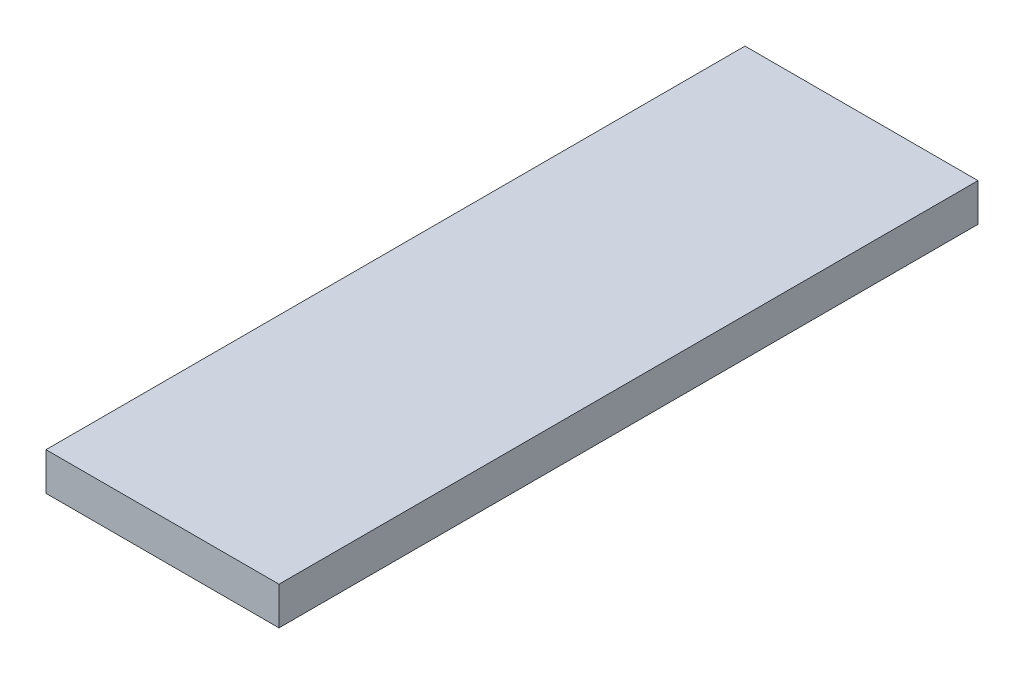
ISO-10303-21;
HEADER;
FILE_DESCRIPTION(('STEP AP214'),'2;1');
FILE_NAME('part.step','',(''),(''),'','','');
FILE_SCHEMA(('AUTOMOTIVE_DESIGN { 1 0 10303 214 1 1 1 1 }'));
ENDSEC;
DATA;
#1=APPLICATION_CONTEXT('core data for automotive mechanical design processes');
#2=APPLICATION_PROTOCOL_DEFINITION('international standard','automotive_design',2000,#1);
#3=PRODUCT_CONTEXT('',#1,'mechanical');
#4=PRODUCT('Part','Part','',(#3));
#5=PRODUCT_RELATED_PRODUCT_CATEGORY('part','',(#4));
#6=PRODUCT_DEFINITION_FORMATION('','',#4);
#7=PRODUCT_DEFINITION_CONTEXT('part definition',#1,'design');
#8=PRODUCT_DEFINITION('design','',#6,#7);
#9=PRODUCT_DEFINITION_SHAPE('','',#8);
#10=(LENGTH_UNIT() NAMED_UNIT(*) SI_UNIT(.MILLI.,.METRE.));
#11=(NAMED_UNIT(*) PLANE_ANGLE_UNIT() SI_UNIT($,.RADIAN.));
#12=(NAMED_UNIT(*) SI_UNIT($,.STERADIAN.) SOLID_ANGLE_UNIT());
#13=UNCERTAINTY_MEASURE_WITH_UNIT(LENGTH_MEASURE(1.E-05),#10,'distance_accuracy_value','');
#14=(GEOMETRIC_REPRESENTATION_CONTEXT(3) GLOBAL_UNCERTAINTY_ASSIGNED_CONTEXT((#13)) GLOBAL_UNIT_ASSIGNED_CONTEXT((#10,
#11,#12)) REPRESENTATION_CONTEXT('',''));
#15=CARTESIAN_POINT('',(0.,0.,0.));
#16=DIRECTION('',(0.,0.,1.));
#17=DIRECTION('',(1.,0.,0.));
#18=AXIS2_PLACEMENT_3D('',#15,#16,#17);
#19=CARTESIAN_POINT('',(0.,6.5,0.));
#20=DIRECTION('',(1.,0.,0.));
#21=DIRECTION('',(0.,0.,-1.));
#22=AXIS2_PLACEMENT_3D('',#19,#20,#21);
#23=PLANE('',#22);
#24=DIRECTION('',(0.,0.,1.));
#25=VECTOR('',#24,1.);
#26=CARTESIAN_POINT('',(0.,0.,0.));
#27=LINE('',#26,#25);
#28=CARTESIAN_POINT('',(0.,0.,-120.));
#29=VERTEX_POINT('',#28);
#30=CARTESIAN_POINT('',(0.,0.,0.));
#31=VERTEX_POINT('',#30);
#32=EDGE_CURVE('E96',#29,#31,#27,.T.);
#33=ORIENTED_EDGE('',*,*,#32,.T.);
#34=DIRECTION('',(0.,-1.,0.));
#35=VECTOR('',#34,1.);
#36=CARTESIAN_POINT('',(0.,6.5,0.));
#37=LINE('',#36,#35);
#38=CARTESIAN_POINT('',(0.,6.5,0.));
#39=VERTEX_POINT('',#38);
#40=EDGE_CURVE('E11',#39,#31,#37,.T.);
#41=ORIENTED_EDGE('',*,*,#40,.F.);
#42=DIRECTION('',(0.,0.,1.));
#43=VECTOR('',#42,1.);
#44=CARTESIAN_POINT('',(0.,6.5,0.));
#45=LINE('',#44,#43);
#46=CARTESIAN_POINT('',(0.,6.5,-120.));
#47=VERTEX_POINT('',#46);
#48=EDGE_CURVE('E84',#47,#39,#45,.T.);
#49=ORIENTED_EDGE('',*,*,#48,.F.);
#50=DIRECTION('',(0.,-1.,0.));
#51=VECTOR('',#50,1.);
#52=CARTESIAN_POINT('',(0.,6.5,-120.));
#53=LINE('',#52,#51);
#54=EDGE_CURVE('E92',#47,#29,#53,.T.);
#55=ORIENTED_EDGE('',*,*,#54,.T.);
#56=EDGE_LOOP('',(#33,#41,#49,#55));
#57=FACE_BOUND('',#56,.T.);
#58=ADVANCED_FACE('F33',(#57),#23,.F.);
#59=CARTESIAN_POINT('',(0.,6.5,0.));
#60=DIRECTION('',(0.,0.,-1.));
#61=DIRECTION('',(-1.,0.,0.));
#62=AXIS2_PLACEMENT_3D('',#59,#60,#61);
#63=PLANE('',#62);
#64=DIRECTION('',(1.,0.,0.));
#65=VECTOR('',#64,1.);
#66=CARTESIAN_POINT('',(0.,0.,0.));
#67=LINE('',#66,#65);
#68=CARTESIAN_POINT('',(40.,0.,0.));
#69=VERTEX_POINT('',#68);
#70=EDGE_CURVE('E88',#31,#69,#67,.T.);
#71=ORIENTED_EDGE('',*,*,#70,.T.);
#72=DIRECTION('',(0.,-1.,0.));
#73=VECTOR('',#72,1.);
#74=CARTESIAN_POINT('',(40.,6.5,0.));
#75=LINE('',#74,#73);
#76=CARTESIAN_POINT('',(40.,6.5,0.));
#77=VERTEX_POINT('',#76);
#78=EDGE_CURVE('E41',#77,#69,#75,.T.);
#79=ORIENTED_EDGE('',*,*,#78,.F.);
#80=DIRECTION('',(1.,0.,0.));
#81=VECTOR('',#80,1.);
#82=CARTESIAN_POINT('',(0.,6.5,0.));
#83=LINE('',#82,#81);
#84=EDGE_CURVE('E79',#39,#77,#83,.T.);
#85=ORIENTED_EDGE('',*,*,#84,.F.);
#86=ORIENTED_EDGE('',*,*,#40,.T.);
#87=EDGE_LOOP('',(#71,#79,#85,#86));
#88=FACE_BOUND('',#87,.T.);
#89=ADVANCED_FACE('F87',(#88),#63,.F.);
#90=CARTESIAN_POINT('',(40.,6.5,0.));
#91=DIRECTION('',(-1.,0.,0.));
#92=DIRECTION('',(0.,0.,1.));
#93=AXIS2_PLACEMENT_3D('',#90,#91,#92);
#94=PLANE('',#93);
#95=DIRECTION('',(0.,0.,-1.));
#96=VECTOR('',#95,1.);
#97=CARTESIAN_POINT('',(40.,0.,0.));
#98=LINE('',#97,#96);
#99=CARTESIAN_POINT('',(40.,0.,-120.));
#100=VERTEX_POINT('',#99);
#101=EDGE_CURVE('E66',#69,#100,#98,.T.);
#102=ORIENTED_EDGE('',*,*,#101,.T.);
#103=DIRECTION('',(0.,-1.,0.));
#104=VECTOR('',#103,1.);
#105=CARTESIAN_POINT('',(40.,6.5,-120.));
#106=LINE('',#105,#104);
#107=CARTESIAN_POINT('',(40.,6.5,-120.));
#108=VERTEX_POINT('',#107);
#109=EDGE_CURVE('E89',#108,#100,#106,.T.);
#110=ORIENTED_EDGE('',*,*,#109,.F.);
#111=DIRECTION('',(0.,0.,-1.));
#112=VECTOR('',#111,1.);
#113=CARTESIAN_POINT('',(40.,6.5,0.));
#114=LINE('',#113,#112);
#115=EDGE_CURVE('E82',#77,#108,#114,.T.);
#116=ORIENTED_EDGE('',*,*,#115,.F.);
#117=ORIENTED_EDGE('',*,*,#78,.T.);
#118=EDGE_LOOP('',(#102,#110,#116,#117));
#119=FACE_BOUND('',#118,.T.);
#120=ADVANCED_FACE('F90',(#119),#94,.F.);
#121=CARTESIAN_POINT('',(0.,6.5,-120.));
#122=DIRECTION('',(0.,0.,1.));
#123=DIRECTION('',(1.,0.,0.));
#124=AXIS2_PLACEMENT_3D('',#121,#122,#123);
#125=PLANE('',#124);
#126=DIRECTION('',(-1.,0.,0.));
#127=VECTOR('',#126,1.);
#128=CARTESIAN_POINT('',(0.,0.,-120.));
#129=LINE('',#128,#127);
#130=EDGE_CURVE('E72',#100,#29,#129,.T.);
#131=ORIENTED_EDGE('',*,*,#130,.T.);
#132=ORIENTED_EDGE('',*,*,#54,.F.);
#133=DIRECTION('',(-1.,0.,0.));
#134=VECTOR('',#133,1.);
#135=CARTESIAN_POINT('',(0.,6.5,-120.));
#136=LINE('',#135,#134);
#137=EDGE_CURVE('E49',#108,#47,#136,.T.);
#138=ORIENTED_EDGE('',*,*,#137,.F.);
#139=ORIENTED_EDGE('',*,*,#109,.T.);
#140=EDGE_LOOP('',(#131,#132,#138,#139));
#141=FACE_BOUND('',#140,.T.);
#142=ADVANCED_FACE('F103',(#141),#125,.F.);
#143=CARTESIAN_POINT('',(0.,6.5,0.));
#144=DIRECTION('',(0.,-1.,0.));
#145=DIRECTION('',(0.,0.,-1.));
#146=AXIS2_PLACEMENT_3D('',#143,#144,#145);
#147=PLANE('',#146);
#148=ORIENTED_EDGE('',*,*,#48,.T.);
#149=ORIENTED_EDGE('',*,*,#84,.T.);
#150=ORIENTED_EDGE('',*,*,#115,.T.);
#151=ORIENTED_EDGE('',*,*,#137,.T.);
#152=EDGE_LOOP('',(#148,#149,#150,#151));
#153=FACE_BOUND('',#152,.T.);
#154=ADVANCED_FACE('F80',(#153),#147,.F.);
#155=CARTESIAN_POINT('',(0.,0.,0.));
#156=DIRECTION('',(0.,-1.,0.));
#157=DIRECTION('',(0.,0.,-1.));
#158=AXIS2_PLACEMENT_3D('',#155,#156,#157);
#159=PLANE('',#158);
#160=ORIENTED_EDGE('',*,*,#32,.F.);
#161=ORIENTED_EDGE('',*,*,#130,.F.);
#162=ORIENTED_EDGE('',*,*,#101,.F.);
#163=ORIENTED_EDGE('',*,*,#70,.F.);
#164=EDGE_LOOP('',(#160,#161,#162,#163));
#165=FACE_BOUND('',#164,.T.);
#166=ADVANCED_FACE('F106',(#165),#159,.T.);
#167=CLOSED_SHELL('',(#58,#89,#120,#142,#154,#166));
#168=MANIFOLD_SOLID_BREP('B2',#167);
#169=ADVANCED_BREP_SHAPE_REPRESENTATION('',(#18,#168),#14);
#170=SHAPE_DEFINITION_REPRESENTATION(#9,#169);
ENDSEC;
END-ISO-10303-21;
